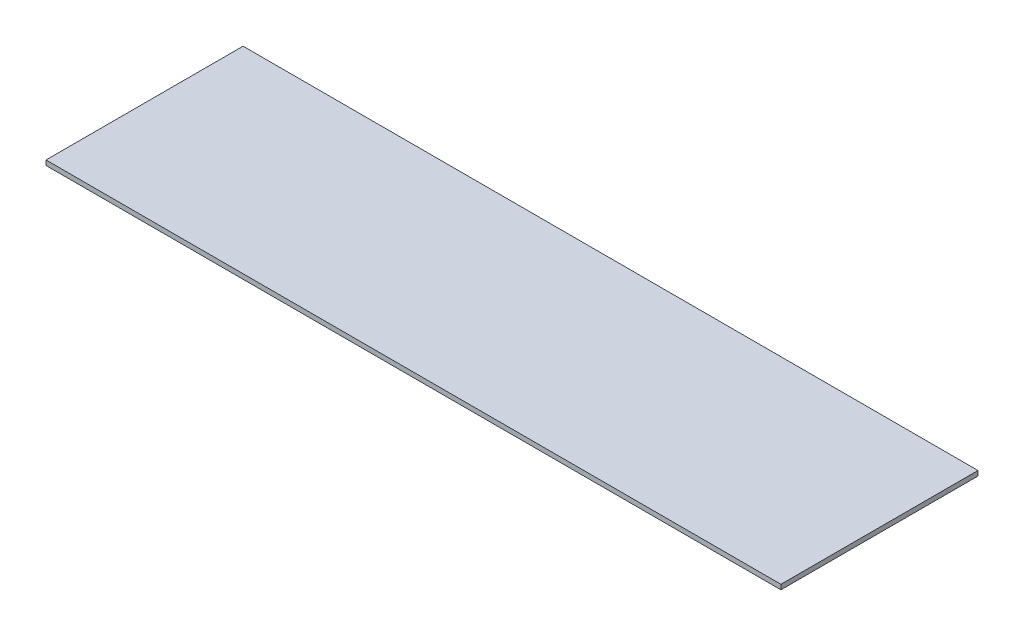
ISO-10303-21;
HEADER;
FILE_DESCRIPTION(('STEP AP214'),'2;1');
FILE_NAME('part.step','',(''),(''),'','','');
FILE_SCHEMA(('AUTOMOTIVE_DESIGN { 1 0 10303 214 1 1 1 1 }'));
ENDSEC;
DATA;
#1=APPLICATION_CONTEXT('core data for automotive mechanical design processes');
#2=APPLICATION_PROTOCOL_DEFINITION('international standard','automotive_design',2000,#1);
#3=PRODUCT_CONTEXT('',#1,'mechanical');
#4=PRODUCT('Part','Part','',(#3));
#5=PRODUCT_RELATED_PRODUCT_CATEGORY('part','',(#4));
#6=PRODUCT_DEFINITION_FORMATION('','',#4);
#7=PRODUCT_DEFINITION_CONTEXT('part definition',#1,'design');
#8=PRODUCT_DEFINITION('design','',#6,#7);
#9=PRODUCT_DEFINITION_SHAPE('','',#8);
#10=(LENGTH_UNIT() NAMED_UNIT(*) SI_UNIT(.MILLI.,.METRE.));
#11=(NAMED_UNIT(*) PLANE_ANGLE_UNIT() SI_UNIT($,.RADIAN.));
#12=(NAMED_UNIT(*) SI_UNIT($,.STERADIAN.) SOLID_ANGLE_UNIT());
#13=UNCERTAINTY_MEASURE_WITH_UNIT(LENGTH_MEASURE(1.E-05),#10,'distance_accuracy_value','');
#14=(GEOMETRIC_REPRESENTATION_CONTEXT(3) GLOBAL_UNCERTAINTY_ASSIGNED_CONTEXT((#13)) GLOBAL_UNIT_ASSIGNED_CONTEXT((#10,
#11,#12)) REPRESENTATION_CONTEXT('',''));
#15=CARTESIAN_POINT('',(0.,0.,0.));
#16=DIRECTION('',(0.,0.,1.));
#17=DIRECTION('',(1.,0.,0.));
#18=AXIS2_PLACEMENT_3D('',#15,#16,#17);
#19=CARTESIAN_POINT('',(0.,1.5875,0.));
#20=DIRECTION('',(1.,0.,0.));
#21=DIRECTION('',(0.,0.,-1.));
#22=AXIS2_PLACEMENT_3D('',#19,#20,#21);
#23=PLANE('',#22);
#24=DIRECTION('',(0.,0.,1.));
#25=VECTOR('',#24,1.);
#26=CARTESIAN_POINT('',(0.,0.,0.));
#27=LINE('',#26,#25);
#28=CARTESIAN_POINT('',(0.,0.,-65.));
#29=VERTEX_POINT('',#28);
#30=CARTESIAN_POINT('',(0.,0.,0.));
#31=VERTEX_POINT('',#30);
#32=EDGE_CURVE('E98',#29,#31,#27,.T.);
#33=ORIENTED_EDGE('',*,*,#32,.T.);
#34=DIRECTION('',(0.,-1.,0.));
#35=VECTOR('',#34,1.);
#36=CARTESIAN_POINT('',(0.,1.5875,0.));
#37=LINE('',#36,#35);
#38=CARTESIAN_POINT('',(0.,1.5875,0.));
#39=VERTEX_POINT('',#38);
#40=EDGE_CURVE('E11',#39,#31,#37,.T.);
#41=ORIENTED_EDGE('',*,*,#40,.F.);
#42=DIRECTION('',(0.,0.,1.));
#43=VECTOR('',#42,1.);
#44=CARTESIAN_POINT('',(0.,1.5875,0.));
#45=LINE('',#44,#43);
#46=CARTESIAN_POINT('',(0.,1.5875,-65.));
#47=VERTEX_POINT('',#46);
#48=EDGE_CURVE('E86',#47,#39,#45,.T.);
#49=ORIENTED_EDGE('',*,*,#48,.F.);
#50=DIRECTION('',(0.,-1.,0.));
#51=VECTOR('',#50,1.);
#52=CARTESIAN_POINT('',(0.,1.5875,-65.));
#53=LINE('',#52,#51);
#54=EDGE_CURVE('E94',#47,#29,#53,.T.);
#55=ORIENTED_EDGE('',*,*,#54,.T.);
#56=EDGE_LOOP('',(#33,#41,#49,#55));
#57=FACE_BOUND('',#56,.T.);
#58=ADVANCED_FACE('F35',(#57),#23,.F.);
#59=CARTESIAN_POINT('',(0.,1.5875,0.));
#60=DIRECTION('',(0.,0.,-1.));
#61=DIRECTION('',(-1.,0.,0.));
#62=AXIS2_PLACEMENT_3D('',#59,#60,#61);
#63=PLANE('',#62);
#64=DIRECTION('',(1.,0.,0.));
#65=VECTOR('',#64,1.);
#66=CARTESIAN_POINT('',(0.,0.,0.));
#67=LINE('',#66,#65);
#68=CARTESIAN_POINT('',(242.4,0.,0.));
#69=VERTEX_POINT('',#68);
#70=EDGE_CURVE('E90',#31,#69,#67,.T.);
#71=ORIENTED_EDGE('',*,*,#70,.T.);
#72=DIRECTION('',(0.,-1.,0.));
#73=VECTOR('',#72,1.);
#74=CARTESIAN_POINT('',(242.4,1.5875,0.));
#75=LINE('',#74,#73);
#76=CARTESIAN_POINT('',(242.4,1.5875,0.));
#77=VERTEX_POINT('',#76);
#78=EDGE_CURVE('E43',#77,#69,#75,.T.);
#79=ORIENTED_EDGE('',*,*,#78,.F.);
#80=DIRECTION('',(1.,0.,0.));
#81=VECTOR('',#80,1.);
#82=CARTESIAN_POINT('',(0.,1.5875,0.));
#83=LINE('',#82,#81);
#84=EDGE_CURVE('E81',#39,#77,#83,.T.);
#85=ORIENTED_EDGE('',*,*,#84,.F.);
#86=ORIENTED_EDGE('',*,*,#40,.T.);
#87=EDGE_LOOP('',(#71,#79,#85,#86));
#88=FACE_BOUND('',#87,.T.);
#89=ADVANCED_FACE('F89',(#88),#63,.F.);
#90=CARTESIAN_POINT('',(242.4,1.5875,0.));
#91=DIRECTION('',(-1.,0.,0.));
#92=DIRECTION('',(0.,0.,1.));
#93=AXIS2_PLACEMENT_3D('',#90,#91,#92);
#94=PLANE('',#93);
#95=DIRECTION('',(0.,0.,-1.));
#96=VECTOR('',#95,1.);
#97=CARTESIAN_POINT('',(242.4,0.,0.));
#98=LINE('',#97,#96);
#99=CARTESIAN_POINT('',(242.4,0.,-65.));
#100=VERTEX_POINT('',#99);
#101=EDGE_CURVE('E68',#69,#100,#98,.T.);
#102=ORIENTED_EDGE('',*,*,#101,.T.);
#103=DIRECTION('',(0.,-1.,0.));
#104=VECTOR('',#103,1.);
#105=CARTESIAN_POINT('',(242.4,1.5875,-65.));
#106=LINE('',#105,#104);
#107=CARTESIAN_POINT('',(242.4,1.5875,-65.));
#108=VERTEX_POINT('',#107);
#109=EDGE_CURVE('E91',#108,#100,#106,.T.);
#110=ORIENTED_EDGE('',*,*,#109,.F.);
#111=DIRECTION('',(0.,0.,-1.));
#112=VECTOR('',#111,1.);
#113=CARTESIAN_POINT('',(242.4,1.5875,0.));
#114=LINE('',#113,#112);
#115=EDGE_CURVE('E84',#77,#108,#114,.T.);
#116=ORIENTED_EDGE('',*,*,#115,.F.);
#117=ORIENTED_EDGE('',*,*,#78,.T.);
#118=EDGE_LOOP('',(#102,#110,#116,#117));
#119=FACE_BOUND('',#118,.T.);
#120=ADVANCED_FACE('F92',(#119),#94,.F.);
#121=CARTESIAN_POINT('',(0.,1.5875,-65.));
#122=DIRECTION('',(0.,0.,1.));
#123=DIRECTION('',(1.,0.,0.));
#124=AXIS2_PLACEMENT_3D('',#121,#122,#123);
#125=PLANE('',#124);
#126=DIRECTION('',(-1.,0.,0.));
#127=VECTOR('',#126,1.);
#128=CARTESIAN_POINT('',(0.,0.,-65.));
#129=LINE('',#128,#127);
#130=EDGE_CURVE('E74',#100,#29,#129,.T.);
#131=ORIENTED_EDGE('',*,*,#130,.T.);
#132=ORIENTED_EDGE('',*,*,#54,.F.);
#133=DIRECTION('',(-1.,0.,0.));
#134=VECTOR('',#133,1.);
#135=CARTESIAN_POINT('',(0.,1.5875,-65.));
#136=LINE('',#135,#134);
#137=EDGE_CURVE('E51',#108,#47,#136,.T.);
#138=ORIENTED_EDGE('',*,*,#137,.F.);
#139=ORIENTED_EDGE('',*,*,#109,.T.);
#140=EDGE_LOOP('',(#131,#132,#138,#139));
#141=FACE_BOUND('',#140,.T.);
#142=ADVANCED_FACE('F105',(#141),#125,.F.);
#143=CARTESIAN_POINT('',(0.,1.5875,0.));
#144=DIRECTION('',(0.,-1.,0.));
#145=DIRECTION('',(0.,0.,-1.));
#146=AXIS2_PLACEMENT_3D('',#143,#144,#145);
#147=PLANE('',#146);
#148=ORIENTED_EDGE('',*,*,#48,.T.);
#149=ORIENTED_EDGE('',*,*,#84,.T.);
#150=ORIENTED_EDGE('',*,*,#115,.T.);
#151=ORIENTED_EDGE('',*,*,#137,.T.);
#152=EDGE_LOOP('',(#148,#149,#150,#151));
#153=FACE_BOUND('',#152,.T.);
#154=ADVANCED_FACE('F82',(#153),#147,.F.);
#155=CARTESIAN_POINT('',(0.,0.,0.));
#156=DIRECTION('',(0.,-1.,0.));
#157=DIRECTION('',(0.,0.,-1.));
#158=AXIS2_PLACEMENT_3D('',#155,#156,#157);
#159=PLANE('',#158);
#160=ORIENTED_EDGE('',*,*,#32,.F.);
#161=ORIENTED_EDGE('',*,*,#130,.F.);
#162=ORIENTED_EDGE('',*,*,#101,.F.);
#163=ORIENTED_EDGE('',*,*,#70,.F.);
#164=EDGE_LOOP('',(#160,#161,#162,#163));
#165=FACE_BOUND('',#164,.T.);
#166=ADVANCED_FACE('F108',(#165),#159,.T.);
#167=CLOSED_SHELL('',(#58,#89,#120,#142,#154,#166));
#168=MANIFOLD_SOLID_BREP('B2',#167);
#169=ADVANCED_BREP_SHAPE_REPRESENTATION('',(#18,#168),#14);
#170=SHAPE_DEFINITION_REPRESENTATION(#9,#169);
ENDSEC;
END-ISO-10303-21;
